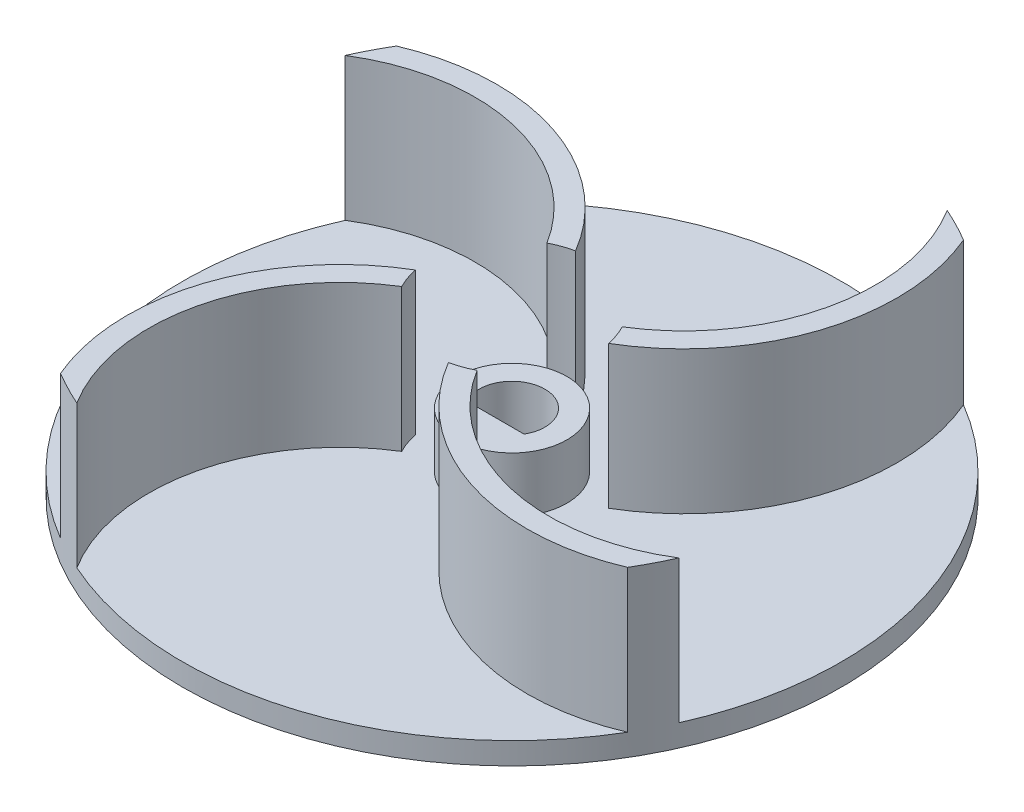
ISO-10303-21;
HEADER;
FILE_DESCRIPTION(('STEP AP214'),'2;1');
FILE_NAME('part.step','',(''),(''),'','','');
FILE_SCHEMA(('AUTOMOTIVE_DESIGN { 1 0 10303 214 1 1 1 1 }'));
ENDSEC;
DATA;
#1=APPLICATION_CONTEXT('core data for automotive mechanical design processes');
#2=APPLICATION_PROTOCOL_DEFINITION('international standard','automotive_design',2000,#1);
#3=PRODUCT_CONTEXT('',#1,'mechanical');
#4=PRODUCT('Part','Part','',(#3));
#5=PRODUCT_RELATED_PRODUCT_CATEGORY('part','',(#4));
#6=PRODUCT_DEFINITION_FORMATION('','',#4);
#7=PRODUCT_DEFINITION_CONTEXT('part definition',#1,'design');
#8=PRODUCT_DEFINITION('design','',#6,#7);
#9=PRODUCT_DEFINITION_SHAPE('','',#8);
#10=(LENGTH_UNIT() NAMED_UNIT(*) SI_UNIT(.MILLI.,.METRE.));
#11=(NAMED_UNIT(*) PLANE_ANGLE_UNIT() SI_UNIT($,.RADIAN.));
#12=(NAMED_UNIT(*) SI_UNIT($,.STERADIAN.) SOLID_ANGLE_UNIT());
#13=UNCERTAINTY_MEASURE_WITH_UNIT(LENGTH_MEASURE(1.E-05),#10,'distance_accuracy_value','');
#14=(GEOMETRIC_REPRESENTATION_CONTEXT(3) GLOBAL_UNCERTAINTY_ASSIGNED_CONTEXT((#13)) GLOBAL_UNIT_ASSIGNED_CONTEXT((#10,
#11,#12)) REPRESENTATION_CONTEXT('',''));
#15=CARTESIAN_POINT('',(0.,0.,0.));
#16=DIRECTION('',(0.,0.,1.));
#17=DIRECTION('',(1.,0.,0.));
#18=AXIS2_PLACEMENT_3D('',#15,#16,#17);
#19=CARTESIAN_POINT('',(0.,0.,0.));
#20=DIRECTION('',(0.,1.,0.));
#21=DIRECTION('',(0.,0.,1.));
#22=AXIS2_PLACEMENT_3D('',#19,#20,#21);
#23=PLANE('',#22);
#24=CARTESIAN_POINT('',(0.,0.,0.));
#25=DIRECTION('',(0.,1.,0.));
#26=DIRECTION('',(0.,0.,1.));
#27=AXIS2_PLACEMENT_3D('',#24,#25,#26);
#28=CIRCLE('',#27,30.);
#29=CARTESIAN_POINT('',(0.,0.,30.));
#30=VERTEX_POINT('',#29);
#31=EDGE_CURVE('E362',#30,#30,#28,.T.);
#32=ORIENTED_EDGE('',*,*,#31,.F.);
#33=EDGE_LOOP('',(#32));
#34=FACE_BOUND('',#33,.T.);
#35=CARTESIAN_POINT('',(0.,0.,0.));
#36=DIRECTION('',(0.,1.,0.));
#37=DIRECTION('',(0.,0.,1.));
#38=AXIS2_PLACEMENT_3D('',#35,#36,#37);
#39=CIRCLE('',#38,3.);
#40=CARTESIAN_POINT('',(2.59807621135332,0.,1.5));
#41=VERTEX_POINT('',#40);
#42=CARTESIAN_POINT('',(-2.59807621135332,0.,1.5));
#43=VERTEX_POINT('',#42);
#44=EDGE_CURVE('E298',#41,#43,#39,.T.);
#45=ORIENTED_EDGE('',*,*,#44,.T.);
#46=DIRECTION('',(1.,0.,0.));
#47=VECTOR('',#46,1.);
#48=CARTESIAN_POINT('',(-2.59807621135332,0.,1.5));
#49=LINE('',#48,#47);
#50=EDGE_CURVE('E302',#43,#41,#49,.T.);
#51=ORIENTED_EDGE('',*,*,#50,.T.);
#52=EDGE_LOOP('',(#45,#51));
#53=FACE_BOUND('',#52,.T.);
#54=ADVANCED_FACE('F45',(#34,#53),#23,.F.);
#55=CARTESIAN_POINT('',(0.,7.,0.));
#56=DIRECTION('',(0.,1.,0.));
#57=DIRECTION('',(0.,0.,1.));
#58=AXIS2_PLACEMENT_3D('',#55,#56,#57);
#59=PLANE('',#58);
#60=CARTESIAN_POINT('',(0.,7.,0.));
#61=DIRECTION('',(0.,1.,0.));
#62=DIRECTION('',(0.,0.,1.));
#63=AXIS2_PLACEMENT_3D('',#60,#61,#62);
#64=CIRCLE('',#63,5.);
#65=CARTESIAN_POINT('',(0.,7.,5.));
#66=VERTEX_POINT('',#65);
#67=EDGE_CURVE('E354',#66,#66,#64,.T.);
#68=ORIENTED_EDGE('',*,*,#67,.T.);
#69=EDGE_LOOP('',(#68));
#70=FACE_BOUND('',#69,.T.);
#71=DIRECTION('',(-1.,0.,0.));
#72=VECTOR('',#71,1.);
#73=CARTESIAN_POINT('',(0.,7.,1.5));
#74=LINE('',#73,#72);
#75=CARTESIAN_POINT('',(2.59807621135332,7.,1.5));
#76=VERTEX_POINT('',#75);
#77=CARTESIAN_POINT('',(-2.59807621135332,7.,1.5));
#78=VERTEX_POINT('',#77);
#79=EDGE_CURVE('E54',#76,#78,#74,.T.);
#80=ORIENTED_EDGE('',*,*,#79,.T.);
#81=CARTESIAN_POINT('',(0.,7.,0.));
#82=DIRECTION('',(0.,1.,0.));
#83=DIRECTION('',(0.,0.,1.));
#84=AXIS2_PLACEMENT_3D('',#81,#82,#83);
#85=CIRCLE('',#84,3.);
#86=EDGE_CURVE('E11',#78,#76,#85,.F.);
#87=ORIENTED_EDGE('',*,*,#86,.T.);
#88=EDGE_LOOP('',(#80,#87));
#89=FACE_BOUND('',#88,.T.);
#90=ADVANCED_FACE('F373',(#70,#89),#59,.T.);
#91=CARTESIAN_POINT('',(0.,2.,0.));
#92=DIRECTION('',(0.,-1.,0.));
#93=DIRECTION('',(0.,0.,-1.));
#94=AXIS2_PLACEMENT_3D('',#91,#92,#93);
#95=CYLINDRICAL_SURFACE('',#94,30.);
#96=CARTESIAN_POINT('',(0.,2.,0.));
#97=DIRECTION('',(0.,1.,0.));
#98=DIRECTION('',(0.,0.,1.));
#99=AXIS2_PLACEMENT_3D('',#96,#97,#98);
#100=CIRCLE('',#99,30.);
#101=CARTESIAN_POINT('',(-27.3998977991763,2.,-12.2166116658709));
#102=VERTEX_POINT('',#101);
#103=CARTESIAN_POINT('',(-15.290670624775,2.,25.8107611636046));
#104=VERTEX_POINT('',#103);
#105=EDGE_CURVE('E363',#102,#104,#100,.T.);
#106=ORIENTED_EDGE('',*,*,#105,.F.);
#107=DIRECTION('',(0.,-1.,0.));
#108=VECTOR('',#107,1.);
#109=CARTESIAN_POINT('',(-27.3998977991763,15.,-12.2166116658709));
#110=LINE('',#109,#108);
#111=CARTESIAN_POINT('',(-27.3998977991763,15.,-12.2166116658709));
#112=VERTEX_POINT('',#111);
#113=EDGE_CURVE('E329',#112,#102,#110,.T.);
#114=ORIENTED_EDGE('',*,*,#113,.F.);
#115=CARTESIAN_POINT('',(0.,15.,0.));
#116=DIRECTION('',(0.,1.,0.));
#117=DIRECTION('',(0.,0.,1.));
#118=AXIS2_PLACEMENT_3D('',#115,#116,#117);
#119=CIRCLE('',#118,30.);
#120=CARTESIAN_POINT('',(-25.8107611636046,15.,-15.2906706247751));
#121=VERTEX_POINT('',#120);
#122=EDGE_CURVE('E326',#121,#112,#119,.T.);
#123=ORIENTED_EDGE('',*,*,#122,.F.);
#124=DIRECTION('',(0.,-1.,0.));
#125=VECTOR('',#124,1.);
#126=CARTESIAN_POINT('',(-25.8107611636046,15.,-15.2906706247751));
#127=LINE('',#126,#125);
#128=CARTESIAN_POINT('',(-25.8107611636046,2.,-15.2906706247751));
#129=VERTEX_POINT('',#128);
#130=EDGE_CURVE('E342',#121,#129,#127,.T.);
#131=ORIENTED_EDGE('',*,*,#130,.T.);
#132=CARTESIAN_POINT('',(12.2166116658707,2.,-27.3998977991764));
#133=VERTEX_POINT('',#132);
#134=EDGE_CURVE('E367',#133,#129,#100,.T.);
#135=ORIENTED_EDGE('',*,*,#134,.F.);
#136=DIRECTION('',(0.,-1.,0.));
#137=VECTOR('',#136,1.);
#138=CARTESIAN_POINT('',(12.2166116658707,15.,-27.3998977991764));
#139=LINE('',#138,#137);
#140=CARTESIAN_POINT('',(12.2166116658707,15.,-27.3998977991764));
#141=VERTEX_POINT('',#140);
#142=EDGE_CURVE('E202',#141,#133,#139,.T.);
#143=ORIENTED_EDGE('',*,*,#142,.F.);
#144=CARTESIAN_POINT('',(0.,15.,0.));
#145=DIRECTION('',(0.,1.,0.));
#146=DIRECTION('',(-1.,0.,0.));
#147=AXIS2_PLACEMENT_3D('',#144,#145,#146);
#148=CIRCLE('',#147,30.);
#149=CARTESIAN_POINT('',(15.2906706247749,15.,-25.8107611636047));
#150=VERTEX_POINT('',#149);
#151=EDGE_CURVE('E188',#150,#141,#148,.T.);
#152=ORIENTED_EDGE('',*,*,#151,.F.);
#153=DIRECTION('',(0.,-1.,0.));
#154=VECTOR('',#153,1.);
#155=CARTESIAN_POINT('',(15.2906706247749,15.,-25.8107611636047));
#156=LINE('',#155,#154);
#157=CARTESIAN_POINT('',(15.2906706247749,2.,-25.8107611636047));
#158=VERTEX_POINT('',#157);
#159=EDGE_CURVE('E211',#150,#158,#156,.T.);
#160=ORIENTED_EDGE('',*,*,#159,.T.);
#161=CARTESIAN_POINT('',(27.3998977991763,2.,12.2166116658709));
#162=VERTEX_POINT('',#161);
#163=EDGE_CURVE('E692',#162,#158,#100,.T.);
#164=ORIENTED_EDGE('',*,*,#163,.F.);
#165=DIRECTION('',(0.,-1.,0.));
#166=VECTOR('',#165,1.);
#167=CARTESIAN_POINT('',(27.3998977991763,15.,12.2166116658709));
#168=LINE('',#167,#166);
#169=CARTESIAN_POINT('',(27.3998977991763,15.,12.2166116658709));
#170=VERTEX_POINT('',#169);
#171=EDGE_CURVE('E232',#170,#162,#168,.T.);
#172=ORIENTED_EDGE('',*,*,#171,.F.);
#173=CARTESIAN_POINT('',(0.,15.,0.));
#174=DIRECTION('',(0.,1.,0.));
#175=DIRECTION('',(0.,0.,-1.));
#176=AXIS2_PLACEMENT_3D('',#173,#174,#175);
#177=CIRCLE('',#176,30.);
#178=CARTESIAN_POINT('',(25.8107611636046,15.,15.2906706247751));
#179=VERTEX_POINT('',#178);
#180=EDGE_CURVE('E229',#179,#170,#177,.T.);
#181=ORIENTED_EDGE('',*,*,#180,.F.);
#182=DIRECTION('',(0.,-1.,0.));
#183=VECTOR('',#182,1.);
#184=CARTESIAN_POINT('',(25.8107611636046,15.,15.2906706247751));
#185=LINE('',#184,#183);
#186=CARTESIAN_POINT('',(25.8107611636046,2.,15.2906706247751));
#187=VERTEX_POINT('',#186);
#188=EDGE_CURVE('E245',#179,#187,#185,.T.);
#189=ORIENTED_EDGE('',*,*,#188,.T.);
#190=CARTESIAN_POINT('',(-12.2166116658708,2.,27.3998977991763));
#191=VERTEX_POINT('',#190);
#192=EDGE_CURVE('E366',#191,#187,#100,.T.);
#193=ORIENTED_EDGE('',*,*,#192,.F.);
#194=DIRECTION('',(0.,-1.,0.));
#195=VECTOR('',#194,1.);
#196=CARTESIAN_POINT('',(-12.2166116658708,15.,27.3998977991763));
#197=LINE('',#196,#195);
#198=CARTESIAN_POINT('',(-12.2166116658708,15.,27.3998977991763));
#199=VERTEX_POINT('',#198);
#200=EDGE_CURVE('E273',#199,#191,#197,.T.);
#201=ORIENTED_EDGE('',*,*,#200,.F.);
#202=CARTESIAN_POINT('',(0.,15.,0.));
#203=DIRECTION('',(0.,1.,0.));
#204=DIRECTION('',(1.,0.,0.));
#205=AXIS2_PLACEMENT_3D('',#202,#203,#204);
#206=CIRCLE('',#205,30.);
#207=CARTESIAN_POINT('',(-15.290670624775,15.,25.8107611636046));
#208=VERTEX_POINT('',#207);
#209=EDGE_CURVE('E270',#208,#199,#206,.T.);
#210=ORIENTED_EDGE('',*,*,#209,.F.);
#211=DIRECTION('',(0.,-1.,0.));
#212=VECTOR('',#211,1.);
#213=CARTESIAN_POINT('',(-15.290670624775,15.,25.8107611636046));
#214=LINE('',#213,#212);
#215=EDGE_CURVE('E286',#208,#104,#214,.T.);
#216=ORIENTED_EDGE('',*,*,#215,.T.);
#217=EDGE_LOOP('',(#106,#114,#123,#131,#135,#143,#152,#160,#164,#172,#181,#189,#193,#201,#210,#216));
#218=FACE_BOUND('',#217,.T.);
#219=ORIENTED_EDGE('',*,*,#31,.T.);
#220=EDGE_LOOP('',(#219));
#221=FACE_BOUND('',#220,.T.);
#222=ADVANCED_FACE('F47',(#218,#221),#95,.T.);
#223=CARTESIAN_POINT('',(0.,2.,0.));
#224=DIRECTION('',(0.,1.,0.));
#225=DIRECTION('',(0.,0.,1.));
#226=AXIS2_PLACEMENT_3D('',#223,#224,#225);
#227=PLANE('',#226);
#228=CARTESIAN_POINT('',(-2.54985655127549,2.,-18.2132610805377));
#229=DIRECTION('',(0.,1.,0.));
#230=DIRECTION('',(-1.,0.,0.));
#231=AXIS2_PLACEMENT_3D('',#228,#229,#230);
#232=CIRCLE('',#231,17.3908849058416);
#233=CARTESIAN_POINT('',(6.60922570995601,2.,-3.42968607513988));
#234=VERTEX_POINT('',#233);
#235=EDGE_CURVE('E176',#234,#133,#232,.T.);
#236=ORIENTED_EDGE('',*,*,#235,.T.);
#237=ORIENTED_EDGE('',*,*,#134,.T.);
#238=CARTESIAN_POINT('',(-18.2132610805377,2.,2.5498565512753));
#239=DIRECTION('',(0.,1.,0.));
#240=DIRECTION('',(0.,0.,1.));
#241=AXIS2_PLACEMENT_3D('',#238,#239,#240);
#242=CIRCLE('',#241,19.3908849058416);
#243=CARTESIAN_POINT('',(-1.50580695138509,2.,-7.29226689612443));
#244=VERTEX_POINT('',#243);
#245=EDGE_CURVE('E319',#244,#129,#242,.T.);
#246=ORIENTED_EDGE('',*,*,#245,.F.);
#247=CARTESIAN_POINT('',(0.,2.,0.));
#248=DIRECTION('',(0.,1.,0.));
#249=DIRECTION('',(0.,0.,1.));
#250=AXIS2_PLACEMENT_3D('',#247,#248,#249);
#251=CIRCLE('',#250,7.44611382260249);
#252=CARTESIAN_POINT('',(-3.42968607513981,2.,-6.60922570995605));
#253=VERTEX_POINT('',#252);
#254=EDGE_CURVE('E333',#244,#253,#251,.T.);
#255=ORIENTED_EDGE('',*,*,#254,.T.);
#256=CARTESIAN_POINT('',(-18.2132610805377,2.,2.5498565512753));
#257=DIRECTION('',(0.,1.,0.));
#258=DIRECTION('',(0.,0.,1.));
#259=AXIS2_PLACEMENT_3D('',#256,#257,#258);
#260=CIRCLE('',#259,17.3908849058416);
#261=EDGE_CURVE('E313',#253,#102,#260,.T.);
#262=ORIENTED_EDGE('',*,*,#261,.T.);
#263=ORIENTED_EDGE('',*,*,#105,.T.);
#264=CARTESIAN_POINT('',(2.54985655127536,2.,18.2132610805377));
#265=DIRECTION('',(0.,1.,0.));
#266=DIRECTION('',(1.,0.,0.));
#267=AXIS2_PLACEMENT_3D('',#264,#265,#266);
#268=CIRCLE('',#267,19.3908849058416);
#269=CARTESIAN_POINT('',(-7.29226689612443,2.,1.50580695138512));
#270=VERTEX_POINT('',#269);
#271=EDGE_CURVE('E263',#270,#104,#268,.T.);
#272=ORIENTED_EDGE('',*,*,#271,.F.);
#273=CARTESIAN_POINT('',(0.,2.,0.));
#274=DIRECTION('',(0.,1.,0.));
#275=DIRECTION('',(1.,0.,0.));
#276=AXIS2_PLACEMENT_3D('',#273,#274,#275);
#277=CIRCLE('',#276,7.44611382260249);
#278=CARTESIAN_POINT('',(-6.60922570995603,2.,3.42968607513984));
#279=VERTEX_POINT('',#278);
#280=EDGE_CURVE('E277',#270,#279,#277,.T.);
#281=ORIENTED_EDGE('',*,*,#280,.T.);
#282=CARTESIAN_POINT('',(2.54985655127536,2.,18.2132610805377));
#283=DIRECTION('',(0.,1.,0.));
#284=DIRECTION('',(1.,0.,0.));
#285=AXIS2_PLACEMENT_3D('',#282,#283,#284);
#286=CIRCLE('',#285,17.3908849058416);
#287=EDGE_CURVE('E257',#279,#191,#286,.T.);
#288=ORIENTED_EDGE('',*,*,#287,.T.);
#289=ORIENTED_EDGE('',*,*,#192,.T.);
#290=CARTESIAN_POINT('',(18.2132610805377,2.,-2.5498565512753));
#291=DIRECTION('',(0.,1.,0.));
#292=DIRECTION('',(0.,0.,-1.));
#293=AXIS2_PLACEMENT_3D('',#290,#291,#292);
#294=CIRCLE('',#293,19.3908849058416);
#295=CARTESIAN_POINT('',(1.50580695138509,2.,7.29226689612443));
#296=VERTEX_POINT('',#295);
#297=EDGE_CURVE('E222',#296,#187,#294,.T.);
#298=ORIENTED_EDGE('',*,*,#297,.F.);
#299=CARTESIAN_POINT('',(0.,2.,0.));
#300=DIRECTION('',(0.,1.,0.));
#301=DIRECTION('',(0.,0.,-1.));
#302=AXIS2_PLACEMENT_3D('',#299,#300,#301);
#303=CIRCLE('',#302,7.44611382260249);
#304=CARTESIAN_POINT('',(3.42968607513981,2.,6.60922570995605));
#305=VERTEX_POINT('',#304);
#306=EDGE_CURVE('E236',#296,#305,#303,.T.);
#307=ORIENTED_EDGE('',*,*,#306,.T.);
#308=CARTESIAN_POINT('',(18.2132610805377,2.,-2.5498565512753));
#309=DIRECTION('',(0.,1.,0.));
#310=DIRECTION('',(0.,0.,-1.));
#311=AXIS2_PLACEMENT_3D('',#308,#309,#310);
#312=CIRCLE('',#311,17.3908849058416);
#313=EDGE_CURVE('E180',#305,#162,#312,.T.);
#314=ORIENTED_EDGE('',*,*,#313,.T.);
#315=ORIENTED_EDGE('',*,*,#163,.T.);
#316=CARTESIAN_POINT('',(-2.54985655127549,2.,-18.2132610805377));
#317=DIRECTION('',(0.,1.,0.));
#318=DIRECTION('',(-1.,0.,0.));
#319=AXIS2_PLACEMENT_3D('',#316,#317,#318);
#320=CIRCLE('',#319,19.3908849058416);
#321=CARTESIAN_POINT('',(7.29226689612442,2.,-1.50580695138517));
#322=VERTEX_POINT('',#321);
#323=EDGE_CURVE('E66',#322,#158,#320,.T.);
#324=ORIENTED_EDGE('',*,*,#323,.F.);
#325=CARTESIAN_POINT('',(0.,2.,0.));
#326=DIRECTION('',(0.,1.,0.));
#327=DIRECTION('',(-1.,0.,0.));
#328=AXIS2_PLACEMENT_3D('',#325,#326,#327);
#329=CIRCLE('',#328,7.44611382260249);
#330=EDGE_CURVE('E61',#322,#234,#329,.T.);
#331=ORIENTED_EDGE('',*,*,#330,.T.);
#332=EDGE_LOOP('',(#236,#237,#246,#255,#262,#263,#272,#281,#288,#289,#298,#307,#314,#315,#324,#331));
#333=FACE_BOUND('',#332,.T.);
#334=CARTESIAN_POINT('',(0.,2.,0.));
#335=DIRECTION('',(0.,1.,0.));
#336=DIRECTION('',(0.,0.,1.));
#337=AXIS2_PLACEMENT_3D('',#334,#335,#336);
#338=CIRCLE('',#337,5.);
#339=CARTESIAN_POINT('',(0.,2.,5.));
#340=VERTEX_POINT('',#339);
#341=EDGE_CURVE('E358',#340,#340,#338,.F.);
#342=ORIENTED_EDGE('',*,*,#341,.T.);
#343=EDGE_LOOP('',(#342));
#344=FACE_BOUND('',#343,.T.);
#345=ADVANCED_FACE('F391',(#333,#344),#227,.T.);
#346=CARTESIAN_POINT('',(0.,7.,0.));
#347=DIRECTION('',(0.,-1.,0.));
#348=DIRECTION('',(0.,0.,-1.));
#349=AXIS2_PLACEMENT_3D('',#346,#347,#348);
#350=CYLINDRICAL_SURFACE('',#349,5.);
#351=ORIENTED_EDGE('',*,*,#341,.F.);
#352=EDGE_LOOP('',(#351));
#353=FACE_BOUND('',#352,.T.);
#354=ORIENTED_EDGE('',*,*,#67,.F.);
#355=EDGE_LOOP('',(#354));
#356=FACE_BOUND('',#355,.T.);
#357=ADVANCED_FACE('F394',(#353,#356),#350,.T.);
#358=CARTESIAN_POINT('',(-18.2132610805377,15.,2.5498565512753));
#359=DIRECTION('',(0.,-1.,0.));
#360=DIRECTION('',(0.,0.,-1.));
#361=AXIS2_PLACEMENT_3D('',#358,#359,#360);
#362=CYLINDRICAL_SURFACE('',#361,17.3908849058416);
#363=ORIENTED_EDGE('',*,*,#261,.F.);
#364=DIRECTION('',(0.,-1.,0.));
#365=VECTOR('',#364,1.);
#366=CARTESIAN_POINT('',(-3.42968607513981,15.,-6.60922570995605));
#367=LINE('',#366,#365);
#368=CARTESIAN_POINT('',(-3.42968607513981,15.,-6.60922570995605));
#369=VERTEX_POINT('',#368);
#370=EDGE_CURVE('E350',#369,#253,#367,.T.);
#371=ORIENTED_EDGE('',*,*,#370,.F.);
#372=CARTESIAN_POINT('',(-18.2132610805377,15.,2.5498565512753));
#373=DIRECTION('',(0.,1.,0.));
#374=DIRECTION('',(0.,0.,1.));
#375=AXIS2_PLACEMENT_3D('',#372,#373,#374);
#376=CIRCLE('',#375,17.3908849058416);
#377=EDGE_CURVE('E314',#369,#112,#376,.T.);
#378=ORIENTED_EDGE('',*,*,#377,.T.);
#379=ORIENTED_EDGE('',*,*,#113,.T.);
#380=EDGE_LOOP('',(#363,#371,#378,#379));
#381=FACE_BOUND('',#380,.T.);
#382=ADVANCED_FACE('F396',(#381),#362,.F.);
#383=CARTESIAN_POINT('',(0.,15.,0.));
#384=DIRECTION('',(0.,-1.,0.));
#385=DIRECTION('',(0.,0.,-1.));
#386=AXIS2_PLACEMENT_3D('',#383,#384,#385);
#387=CYLINDRICAL_SURFACE('',#386,7.44611382260249);
#388=ORIENTED_EDGE('',*,*,#254,.F.);
#389=DIRECTION('',(0.,-1.,0.));
#390=VECTOR('',#389,1.);
#391=CARTESIAN_POINT('',(-1.50580695138509,15.,-7.29226689612443));
#392=LINE('',#391,#390);
#393=CARTESIAN_POINT('',(-1.50580695138509,15.,-7.29226689612443));
#394=VERTEX_POINT('',#393);
#395=EDGE_CURVE('E346',#394,#244,#392,.T.);
#396=ORIENTED_EDGE('',*,*,#395,.F.);
#397=CARTESIAN_POINT('',(0.,15.,0.));
#398=DIRECTION('',(0.,1.,0.));
#399=DIRECTION('',(0.,0.,1.));
#400=AXIS2_PLACEMENT_3D('',#397,#398,#399);
#401=CIRCLE('',#400,7.44611382260249);
#402=EDGE_CURVE('E318',#394,#369,#401,.T.);
#403=ORIENTED_EDGE('',*,*,#402,.T.);
#404=ORIENTED_EDGE('',*,*,#370,.T.);
#405=EDGE_LOOP('',(#388,#396,#403,#404));
#406=FACE_BOUND('',#405,.T.);
#407=ADVANCED_FACE('F401',(#406),#387,.F.);
#408=CARTESIAN_POINT('',(-18.2132610805377,15.,2.5498565512753));
#409=DIRECTION('',(0.,-1.,0.));
#410=DIRECTION('',(0.,0.,-1.));
#411=AXIS2_PLACEMENT_3D('',#408,#409,#410);
#412=CYLINDRICAL_SURFACE('',#411,19.3908849058416);
#413=ORIENTED_EDGE('',*,*,#245,.T.);
#414=ORIENTED_EDGE('',*,*,#130,.F.);
#415=CARTESIAN_POINT('',(-18.2132610805377,15.,2.5498565512753));
#416=DIRECTION('',(0.,1.,0.));
#417=DIRECTION('',(0.,0.,1.));
#418=AXIS2_PLACEMENT_3D('',#415,#416,#417);
#419=CIRCLE('',#418,19.3908849058416);
#420=EDGE_CURVE('E323',#394,#121,#419,.T.);
#421=ORIENTED_EDGE('',*,*,#420,.F.);
#422=ORIENTED_EDGE('',*,*,#395,.T.);
#423=EDGE_LOOP('',(#413,#414,#421,#422));
#424=FACE_BOUND('',#423,.T.);
#425=ADVANCED_FACE('F405',(#424),#412,.T.);
#426=CARTESIAN_POINT('',(0.,15.,0.));
#427=DIRECTION('',(0.,1.,0.));
#428=DIRECTION('',(0.,0.,1.));
#429=AXIS2_PLACEMENT_3D('',#426,#427,#428);
#430=PLANE('',#429);
#431=ORIENTED_EDGE('',*,*,#377,.F.);
#432=ORIENTED_EDGE('',*,*,#402,.F.);
#433=ORIENTED_EDGE('',*,*,#420,.T.);
#434=ORIENTED_EDGE('',*,*,#122,.T.);
#435=EDGE_LOOP('',(#431,#432,#433,#434));
#436=FACE_BOUND('',#435,.T.);
#437=ADVANCED_FACE('F409',(#436),#430,.T.);
#438=CARTESIAN_POINT('',(0.,15.,0.));
#439=DIRECTION('',(0.,-1.,0.));
#440=DIRECTION('',(0.,0.,-1.));
#441=AXIS2_PLACEMENT_3D('',#438,#439,#440);
#442=CYLINDRICAL_SURFACE('',#441,3.);
#443=DIRECTION('',(0.,-1.,0.));
#444=VECTOR('',#443,1.);
#445=CARTESIAN_POINT('',(-2.59807621135332,15.,1.5));
#446=LINE('',#445,#444);
#447=EDGE_CURVE('E310',#78,#43,#446,.T.);
#448=ORIENTED_EDGE('',*,*,#447,.T.);
#449=ORIENTED_EDGE('',*,*,#44,.F.);
#450=DIRECTION('',(0.,-1.,0.));
#451=VECTOR('',#450,1.);
#452=CARTESIAN_POINT('',(2.59807621135332,15.,1.5));
#453=LINE('',#452,#451);
#454=EDGE_CURVE('E306',#76,#41,#453,.T.);
#455=ORIENTED_EDGE('',*,*,#454,.F.);
#456=ORIENTED_EDGE('',*,*,#86,.F.);
#457=EDGE_LOOP('',(#448,#449,#455,#456));
#458=FACE_BOUND('',#457,.T.);
#459=ADVANCED_FACE('F380',(#458),#442,.F.);
#460=CARTESIAN_POINT('',(-2.59807621135332,15.,1.5));
#461=DIRECTION('',(0.,0.,-1.));
#462=DIRECTION('',(-1.,0.,0.));
#463=AXIS2_PLACEMENT_3D('',#460,#461,#462);
#464=PLANE('',#463);
#465=ORIENTED_EDGE('',*,*,#454,.T.);
#466=ORIENTED_EDGE('',*,*,#50,.F.);
#467=ORIENTED_EDGE('',*,*,#447,.F.);
#468=ORIENTED_EDGE('',*,*,#79,.F.);
#469=EDGE_LOOP('',(#465,#466,#467,#468));
#470=FACE_BOUND('',#469,.T.);
#471=ADVANCED_FACE('F377',(#470),#464,.T.);
#472=CARTESIAN_POINT('',(2.54985655127536,15.,18.2132610805377));
#473=DIRECTION('',(0.,-1.,0.));
#474=DIRECTION('',(0.,0.,-1.));
#475=AXIS2_PLACEMENT_3D('',#472,#473,#474);
#476=CYLINDRICAL_SURFACE('',#475,17.3908849058416);
#477=ORIENTED_EDGE('',*,*,#287,.F.);
#478=DIRECTION('',(0.,-1.,0.));
#479=VECTOR('',#478,1.);
#480=CARTESIAN_POINT('',(-6.60922570995603,15.,3.42968607513984));
#481=LINE('',#480,#479);
#482=CARTESIAN_POINT('',(-6.60922570995603,15.,3.42968607513984));
#483=VERTEX_POINT('',#482);
#484=EDGE_CURVE('E294',#483,#279,#481,.T.);
#485=ORIENTED_EDGE('',*,*,#484,.F.);
#486=CARTESIAN_POINT('',(2.54985655127536,15.,18.2132610805377));
#487=DIRECTION('',(0.,1.,0.));
#488=DIRECTION('',(1.,0.,0.));
#489=AXIS2_PLACEMENT_3D('',#486,#487,#488);
#490=CIRCLE('',#489,17.3908849058416);
#491=EDGE_CURVE('E258',#483,#199,#490,.T.);
#492=ORIENTED_EDGE('',*,*,#491,.T.);
#493=ORIENTED_EDGE('',*,*,#200,.T.);
#494=EDGE_LOOP('',(#477,#485,#492,#493));
#495=FACE_BOUND('',#494,.T.);
#496=ADVANCED_FACE('F418',(#495),#476,.F.);
#497=CARTESIAN_POINT('',(0.,15.,0.));
#498=DIRECTION('',(0.,-1.,0.));
#499=DIRECTION('',(0.,0.,-1.));
#500=AXIS2_PLACEMENT_3D('',#497,#498,#499);
#501=CYLINDRICAL_SURFACE('',#500,7.44611382260249);
#502=ORIENTED_EDGE('',*,*,#280,.F.);
#503=DIRECTION('',(0.,-1.,0.));
#504=VECTOR('',#503,1.);
#505=CARTESIAN_POINT('',(-7.29226689612443,15.,1.50580695138512));
#506=LINE('',#505,#504);
#507=CARTESIAN_POINT('',(-7.29226689612443,15.,1.50580695138512));
#508=VERTEX_POINT('',#507);
#509=EDGE_CURVE('E290',#508,#270,#506,.T.);
#510=ORIENTED_EDGE('',*,*,#509,.F.);
#511=CARTESIAN_POINT('',(0.,15.,0.));
#512=DIRECTION('',(0.,1.,0.));
#513=DIRECTION('',(1.,0.,0.));
#514=AXIS2_PLACEMENT_3D('',#511,#512,#513);
#515=CIRCLE('',#514,7.44611382260249);
#516=EDGE_CURVE('E262',#508,#483,#515,.T.);
#517=ORIENTED_EDGE('',*,*,#516,.T.);
#518=ORIENTED_EDGE('',*,*,#484,.T.);
#519=EDGE_LOOP('',(#502,#510,#517,#518));
#520=FACE_BOUND('',#519,.T.);
#521=ADVANCED_FACE('F421',(#520),#501,.F.);
#522=CARTESIAN_POINT('',(2.54985655127536,15.,18.2132610805377));
#523=DIRECTION('',(0.,-1.,0.));
#524=DIRECTION('',(0.,0.,-1.));
#525=AXIS2_PLACEMENT_3D('',#522,#523,#524);
#526=CYLINDRICAL_SURFACE('',#525,19.3908849058416);
#527=ORIENTED_EDGE('',*,*,#271,.T.);
#528=ORIENTED_EDGE('',*,*,#215,.F.);
#529=CARTESIAN_POINT('',(2.54985655127536,15.,18.2132610805377));
#530=DIRECTION('',(0.,1.,0.));
#531=DIRECTION('',(1.,0.,0.));
#532=AXIS2_PLACEMENT_3D('',#529,#530,#531);
#533=CIRCLE('',#532,19.3908849058416);
#534=EDGE_CURVE('E267',#508,#208,#533,.T.);
#535=ORIENTED_EDGE('',*,*,#534,.F.);
#536=ORIENTED_EDGE('',*,*,#509,.T.);
#537=EDGE_LOOP('',(#527,#528,#535,#536));
#538=FACE_BOUND('',#537,.T.);
#539=ADVANCED_FACE('F425',(#538),#526,.T.);
#540=CARTESIAN_POINT('',(0.,15.,0.));
#541=DIRECTION('',(0.,1.,0.));
#542=DIRECTION('',(1.,0.,0.));
#543=AXIS2_PLACEMENT_3D('',#540,#541,#542);
#544=PLANE('',#543);
#545=ORIENTED_EDGE('',*,*,#491,.F.);
#546=ORIENTED_EDGE('',*,*,#516,.F.);
#547=ORIENTED_EDGE('',*,*,#534,.T.);
#548=ORIENTED_EDGE('',*,*,#209,.T.);
#549=EDGE_LOOP('',(#545,#546,#547,#548));
#550=FACE_BOUND('',#549,.T.);
#551=ADVANCED_FACE('F429',(#550),#544,.T.);
#552=CARTESIAN_POINT('',(18.2132610805377,15.,-2.5498565512753));
#553=DIRECTION('',(0.,-1.,0.));
#554=DIRECTION('',(0.,0.,-1.));
#555=AXIS2_PLACEMENT_3D('',#552,#553,#554);
#556=CYLINDRICAL_SURFACE('',#555,17.3908849058416);
#557=ORIENTED_EDGE('',*,*,#313,.F.);
#558=DIRECTION('',(0.,-1.,0.));
#559=VECTOR('',#558,1.);
#560=CARTESIAN_POINT('',(3.42968607513981,15.,6.60922570995605));
#561=LINE('',#560,#559);
#562=CARTESIAN_POINT('',(3.42968607513981,15.,6.60922570995605));
#563=VERTEX_POINT('',#562);
#564=EDGE_CURVE('E253',#563,#305,#561,.T.);
#565=ORIENTED_EDGE('',*,*,#564,.F.);
#566=CARTESIAN_POINT('',(18.2132610805377,15.,-2.5498565512753));
#567=DIRECTION('',(0.,1.,0.));
#568=DIRECTION('',(0.,0.,-1.));
#569=AXIS2_PLACEMENT_3D('',#566,#567,#568);
#570=CIRCLE('',#569,17.3908849058416);
#571=EDGE_CURVE('E217',#563,#170,#570,.T.);
#572=ORIENTED_EDGE('',*,*,#571,.T.);
#573=ORIENTED_EDGE('',*,*,#171,.T.);
#574=EDGE_LOOP('',(#557,#565,#572,#573));
#575=FACE_BOUND('',#574,.T.);
#576=ADVANCED_FACE('F433',(#575),#556,.F.);
#577=CARTESIAN_POINT('',(0.,15.,0.));
#578=DIRECTION('',(0.,-1.,0.));
#579=DIRECTION('',(0.,0.,-1.));
#580=AXIS2_PLACEMENT_3D('',#577,#578,#579);
#581=CYLINDRICAL_SURFACE('',#580,7.44611382260249);
#582=ORIENTED_EDGE('',*,*,#306,.F.);
#583=DIRECTION('',(0.,-1.,0.));
#584=VECTOR('',#583,1.);
#585=CARTESIAN_POINT('',(1.50580695138509,15.,7.29226689612443));
#586=LINE('',#585,#584);
#587=CARTESIAN_POINT('',(1.50580695138509,15.,7.29226689612443));
#588=VERTEX_POINT('',#587);
#589=EDGE_CURVE('E249',#588,#296,#586,.T.);
#590=ORIENTED_EDGE('',*,*,#589,.F.);
#591=CARTESIAN_POINT('',(0.,15.,0.));
#592=DIRECTION('',(0.,1.,0.));
#593=DIRECTION('',(0.,0.,-1.));
#594=AXIS2_PLACEMENT_3D('',#591,#592,#593);
#595=CIRCLE('',#594,7.44611382260249);
#596=EDGE_CURVE('E221',#588,#563,#595,.T.);
#597=ORIENTED_EDGE('',*,*,#596,.T.);
#598=ORIENTED_EDGE('',*,*,#564,.T.);
#599=EDGE_LOOP('',(#582,#590,#597,#598));
#600=FACE_BOUND('',#599,.T.);
#601=ADVANCED_FACE('F437',(#600),#581,.F.);
#602=CARTESIAN_POINT('',(18.2132610805377,15.,-2.5498565512753));
#603=DIRECTION('',(0.,-1.,0.));
#604=DIRECTION('',(0.,0.,-1.));
#605=AXIS2_PLACEMENT_3D('',#602,#603,#604);
#606=CYLINDRICAL_SURFACE('',#605,19.3908849058416);
#607=ORIENTED_EDGE('',*,*,#297,.T.);
#608=ORIENTED_EDGE('',*,*,#188,.F.);
#609=CARTESIAN_POINT('',(18.2132610805377,15.,-2.5498565512753));
#610=DIRECTION('',(0.,1.,0.));
#611=DIRECTION('',(0.,0.,-1.));
#612=AXIS2_PLACEMENT_3D('',#609,#610,#611);
#613=CIRCLE('',#612,19.3908849058416);
#614=EDGE_CURVE('E226',#588,#179,#613,.T.);
#615=ORIENTED_EDGE('',*,*,#614,.F.);
#616=ORIENTED_EDGE('',*,*,#589,.T.);
#617=EDGE_LOOP('',(#607,#608,#615,#616));
#618=FACE_BOUND('',#617,.T.);
#619=ADVANCED_FACE('F441',(#618),#606,.T.);
#620=CARTESIAN_POINT('',(0.,15.,0.));
#621=DIRECTION('',(0.,1.,0.));
#622=DIRECTION('',(0.,0.,-1.));
#623=AXIS2_PLACEMENT_3D('',#620,#621,#622);
#624=PLANE('',#623);
#625=ORIENTED_EDGE('',*,*,#571,.F.);
#626=ORIENTED_EDGE('',*,*,#596,.F.);
#627=ORIENTED_EDGE('',*,*,#614,.T.);
#628=ORIENTED_EDGE('',*,*,#180,.T.);
#629=EDGE_LOOP('',(#625,#626,#627,#628));
#630=FACE_BOUND('',#629,.T.);
#631=ADVANCED_FACE('F445',(#630),#624,.T.);
#632=CARTESIAN_POINT('',(-2.54985655127549,15.,-18.2132610805377));
#633=DIRECTION('',(0.,-1.,0.));
#634=DIRECTION('',(0.,0.,-1.));
#635=AXIS2_PLACEMENT_3D('',#632,#633,#634);
#636=CYLINDRICAL_SURFACE('',#635,17.3908849058416);
#637=ORIENTED_EDGE('',*,*,#235,.F.);
#638=DIRECTION('',(0.,-1.,0.));
#639=VECTOR('',#638,1.);
#640=CARTESIAN_POINT('',(6.60922570995601,15.,-3.42968607513988));
#641=LINE('',#640,#639);
#642=CARTESIAN_POINT('',(6.60922570995601,15.,-3.42968607513988));
#643=VERTEX_POINT('',#642);
#644=EDGE_CURVE('E171',#643,#234,#641,.T.);
#645=ORIENTED_EDGE('',*,*,#644,.F.);
#646=CARTESIAN_POINT('',(-2.54985655127549,15.,-18.2132610805377));
#647=DIRECTION('',(0.,1.,0.));
#648=DIRECTION('',(-1.,0.,0.));
#649=AXIS2_PLACEMENT_3D('',#646,#647,#648);
#650=CIRCLE('',#649,17.3908849058416);
#651=EDGE_CURVE('E175',#643,#141,#650,.T.);
#652=ORIENTED_EDGE('',*,*,#651,.T.);
#653=ORIENTED_EDGE('',*,*,#142,.T.);
#654=EDGE_LOOP('',(#637,#645,#652,#653));
#655=FACE_BOUND('',#654,.T.);
#656=ADVANCED_FACE('F173',(#655),#636,.F.);
#657=CARTESIAN_POINT('',(0.,15.,0.));
#658=DIRECTION('',(0.,-1.,0.));
#659=DIRECTION('',(0.,0.,-1.));
#660=AXIS2_PLACEMENT_3D('',#657,#658,#659);
#661=CYLINDRICAL_SURFACE('',#660,7.44611382260249);
#662=ORIENTED_EDGE('',*,*,#330,.F.);
#663=DIRECTION('',(0.,-1.,0.));
#664=VECTOR('',#663,1.);
#665=CARTESIAN_POINT('',(7.29226689612442,15.,-1.50580695138517));
#666=LINE('',#665,#664);
#667=CARTESIAN_POINT('',(7.29226689612442,15.,-1.50580695138517));
#668=VERTEX_POINT('',#667);
#669=EDGE_CURVE('E181',#668,#322,#666,.T.);
#670=ORIENTED_EDGE('',*,*,#669,.F.);
#671=CARTESIAN_POINT('',(0.,15.,0.));
#672=DIRECTION('',(0.,1.,0.));
#673=DIRECTION('',(-1.,0.,0.));
#674=AXIS2_PLACEMENT_3D('',#671,#672,#673);
#675=CIRCLE('',#674,7.44611382260249);
#676=EDGE_CURVE('E186',#668,#643,#675,.T.);
#677=ORIENTED_EDGE('',*,*,#676,.T.);
#678=ORIENTED_EDGE('',*,*,#644,.T.);
#679=EDGE_LOOP('',(#662,#670,#677,#678));
#680=FACE_BOUND('',#679,.T.);
#681=ADVANCED_FACE('F192',(#680),#661,.F.);
#682=CARTESIAN_POINT('',(-2.54985655127549,15.,-18.2132610805377));
#683=DIRECTION('',(0.,-1.,0.));
#684=DIRECTION('',(0.,0.,-1.));
#685=AXIS2_PLACEMENT_3D('',#682,#683,#684);
#686=CYLINDRICAL_SURFACE('',#685,19.3908849058416);
#687=ORIENTED_EDGE('',*,*,#323,.T.);
#688=ORIENTED_EDGE('',*,*,#159,.F.);
#689=CARTESIAN_POINT('',(-2.54985655127549,15.,-18.2132610805377));
#690=DIRECTION('',(0.,1.,0.));
#691=DIRECTION('',(-1.,0.,0.));
#692=AXIS2_PLACEMENT_3D('',#689,#690,#691);
#693=CIRCLE('',#692,19.3908849058416);
#694=EDGE_CURVE('E195',#668,#150,#693,.T.);
#695=ORIENTED_EDGE('',*,*,#694,.F.);
#696=ORIENTED_EDGE('',*,*,#669,.T.);
#697=EDGE_LOOP('',(#687,#688,#695,#696));
#698=FACE_BOUND('',#697,.T.);
#699=ADVANCED_FACE('F454',(#698),#686,.T.);
#700=CARTESIAN_POINT('',(0.,15.,0.));
#701=DIRECTION('',(0.,1.,0.));
#702=DIRECTION('',(-1.,0.,0.));
#703=AXIS2_PLACEMENT_3D('',#700,#701,#702);
#704=PLANE('',#703);
#705=ORIENTED_EDGE('',*,*,#651,.F.);
#706=ORIENTED_EDGE('',*,*,#676,.F.);
#707=ORIENTED_EDGE('',*,*,#694,.T.);
#708=ORIENTED_EDGE('',*,*,#151,.T.);
#709=EDGE_LOOP('',(#705,#706,#707,#708));
#710=FACE_BOUND('',#709,.T.);
#711=ADVANCED_FACE('F185',(#710),#704,.T.);
#712=CLOSED_SHELL('',(#54,#90,#222,#345,#357,#382,#407,#425,#437,#459,#471,#496,#521,#539,#551,
#576,#601,#619,#631,#656,#681,#699,#711));
#713=MANIFOLD_SOLID_BREP('B2',#712);
#714=ADVANCED_BREP_SHAPE_REPRESENTATION('',(#18,#713),#14);
#715=SHAPE_DEFINITION_REPRESENTATION(#9,#714);
ENDSEC;
END-ISO-10303-21;
